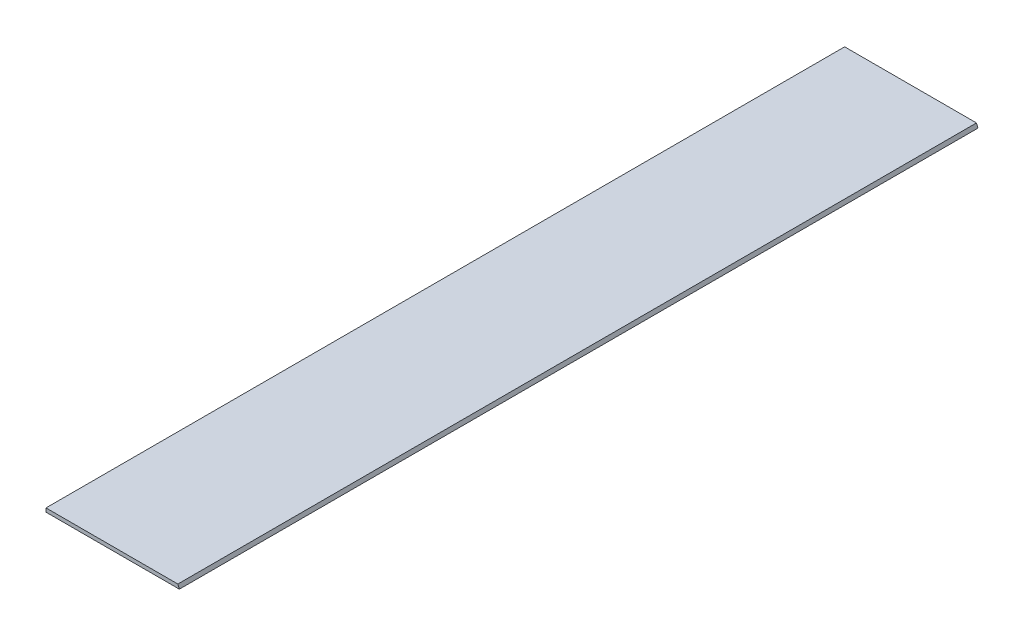
ISO-10303-21;
HEADER;
FILE_DESCRIPTION(('STEP AP214'),'2;1');
FILE_NAME('part.step','',(''),(''),'','','');
FILE_SCHEMA(('AUTOMOTIVE_DESIGN { 1 0 10303 214 1 1 1 1 }'));
ENDSEC;
DATA;
#1=APPLICATION_CONTEXT('core data for automotive mechanical design processes');
#2=APPLICATION_PROTOCOL_DEFINITION('international standard','automotive_design',2000,#1);
#3=PRODUCT_CONTEXT('',#1,'mechanical');
#4=PRODUCT('Part','Part','',(#3));
#5=PRODUCT_RELATED_PRODUCT_CATEGORY('part','',(#4));
#6=PRODUCT_DEFINITION_FORMATION('','',#4);
#7=PRODUCT_DEFINITION_CONTEXT('part definition',#1,'design');
#8=PRODUCT_DEFINITION('design','',#6,#7);
#9=PRODUCT_DEFINITION_SHAPE('','',#8);
#10=(LENGTH_UNIT() NAMED_UNIT(*) SI_UNIT(.MILLI.,.METRE.));
#11=(NAMED_UNIT(*) PLANE_ANGLE_UNIT() SI_UNIT($,.RADIAN.));
#12=(NAMED_UNIT(*) SI_UNIT($,.STERADIAN.) SOLID_ANGLE_UNIT());
#13=UNCERTAINTY_MEASURE_WITH_UNIT(LENGTH_MEASURE(1.E-05),#10,'distance_accuracy_value','');
#14=(GEOMETRIC_REPRESENTATION_CONTEXT(3) GLOBAL_UNCERTAINTY_ASSIGNED_CONTEXT((#13)) GLOBAL_UNIT_ASSIGNED_CONTEXT((#10,
#11,#12)) REPRESENTATION_CONTEXT('',''));
#15=CARTESIAN_POINT('',(0.,0.,0.));
#16=DIRECTION('',(0.,0.,1.));
#17=DIRECTION('',(1.,0.,0.));
#18=AXIS2_PLACEMENT_3D('',#15,#16,#17);
#19=CARTESIAN_POINT('',(84.836,0.,508.));
#20=DIRECTION('',(0.,1.,0.));
#21=DIRECTION('',(-1.,0.,0.));
#22=AXIS2_PLACEMENT_3D('',#19,#20,#21);
#23=PLANE('',#22);
#24=DIRECTION('',(1.,0.,0.));
#25=VECTOR('',#24,1.);
#26=CARTESIAN_POINT('',(84.836,0.,0.));
#27=LINE('',#26,#25);
#28=CARTESIAN_POINT('',(0.,0.,0.));
#29=VERTEX_POINT('',#28);
#30=CARTESIAN_POINT('',(84.836,0.,0.));
#31=VERTEX_POINT('',#30);
#32=EDGE_CURVE('E98',#29,#31,#27,.T.);
#33=ORIENTED_EDGE('',*,*,#32,.T.);
#34=DIRECTION('',(0.,0.,-1.));
#35=VECTOR('',#34,1.);
#36=CARTESIAN_POINT('',(84.836,0.,508.));
#37=LINE('',#36,#35);
#38=CARTESIAN_POINT('',(84.836,0.,508.));
#39=VERTEX_POINT('',#38);
#40=EDGE_CURVE('E11',#39,#31,#37,.T.);
#41=ORIENTED_EDGE('',*,*,#40,.F.);
#42=DIRECTION('',(1.,0.,0.));
#43=VECTOR('',#42,1.);
#44=CARTESIAN_POINT('',(84.836,0.,508.));
#45=LINE('',#44,#43);
#46=CARTESIAN_POINT('',(0.,0.,508.));
#47=VERTEX_POINT('',#46);
#48=EDGE_CURVE('E86',#47,#39,#45,.T.);
#49=ORIENTED_EDGE('',*,*,#48,.F.);
#50=DIRECTION('',(0.,0.,-1.));
#51=VECTOR('',#50,1.);
#52=CARTESIAN_POINT('',(0.,0.,508.));
#53=LINE('',#52,#51);
#54=EDGE_CURVE('E94',#47,#29,#53,.T.);
#55=ORIENTED_EDGE('',*,*,#54,.T.);
#56=EDGE_LOOP('',(#33,#41,#49,#55));
#57=FACE_BOUND('',#56,.T.);
#58=ADVANCED_FACE('F35',(#57),#23,.F.);
#59=CARTESIAN_POINT('',(83.8575447229623,2.36219999999999,508.));
#60=DIRECTION('',(-0.923879532511286,-0.382683432365092,0.));
#61=DIRECTION('',(0.382683432365092,-0.923879532511286,0.));
#62=AXIS2_PLACEMENT_3D('',#59,#60,#61);
#63=PLANE('',#62);
#64=DIRECTION('',(-0.382683432365092,0.923879532511286,0.));
#65=VECTOR('',#64,1.);
#66=CARTESIAN_POINT('',(83.8575447229623,2.36219999999999,0.));
#67=LINE('',#66,#65);
#68=CARTESIAN_POINT('',(83.8575447229623,2.36219999999999,0.));
#69=VERTEX_POINT('',#68);
#70=EDGE_CURVE('E90',#31,#69,#67,.T.);
#71=ORIENTED_EDGE('',*,*,#70,.T.);
#72=DIRECTION('',(0.,0.,-1.));
#73=VECTOR('',#72,1.);
#74=CARTESIAN_POINT('',(83.8575447229623,2.36219999999999,508.));
#75=LINE('',#74,#73);
#76=CARTESIAN_POINT('',(83.8575447229623,2.36219999999999,508.));
#77=VERTEX_POINT('',#76);
#78=EDGE_CURVE('E43',#77,#69,#75,.T.);
#79=ORIENTED_EDGE('',*,*,#78,.F.);
#80=DIRECTION('',(-0.382683432365092,0.923879532511286,0.));
#81=VECTOR('',#80,1.);
#82=CARTESIAN_POINT('',(83.8575447229623,2.36219999999999,508.));
#83=LINE('',#82,#81);
#84=EDGE_CURVE('E81',#39,#77,#83,.T.);
#85=ORIENTED_EDGE('',*,*,#84,.F.);
#86=ORIENTED_EDGE('',*,*,#40,.T.);
#87=EDGE_LOOP('',(#71,#79,#85,#86));
#88=FACE_BOUND('',#87,.T.);
#89=ADVANCED_FACE('F89',(#88),#63,.F.);
#90=CARTESIAN_POINT('',(0.,2.36219999999999,508.));
#91=DIRECTION('',(0.,-1.,0.));
#92=DIRECTION('',(0.,0.,-1.));
#93=AXIS2_PLACEMENT_3D('',#90,#91,#92);
#94=PLANE('',#93);
#95=DIRECTION('',(-1.,0.,0.));
#96=VECTOR('',#95,1.);
#97=CARTESIAN_POINT('',(0.,2.36219999999999,0.));
#98=LINE('',#97,#96);
#99=CARTESIAN_POINT('',(0.,2.36219999999999,0.));
#100=VERTEX_POINT('',#99);
#101=EDGE_CURVE('E68',#69,#100,#98,.T.);
#102=ORIENTED_EDGE('',*,*,#101,.T.);
#103=DIRECTION('',(0.,0.,-1.));
#104=VECTOR('',#103,1.);
#105=CARTESIAN_POINT('',(0.,2.36219999999999,508.));
#106=LINE('',#105,#104);
#107=CARTESIAN_POINT('',(0.,2.36219999999999,508.));
#108=VERTEX_POINT('',#107);
#109=EDGE_CURVE('E91',#108,#100,#106,.T.);
#110=ORIENTED_EDGE('',*,*,#109,.F.);
#111=DIRECTION('',(-1.,0.,0.));
#112=VECTOR('',#111,1.);
#113=CARTESIAN_POINT('',(0.,2.36219999999999,508.));
#114=LINE('',#113,#112);
#115=EDGE_CURVE('E84',#77,#108,#114,.T.);
#116=ORIENTED_EDGE('',*,*,#115,.F.);
#117=ORIENTED_EDGE('',*,*,#78,.T.);
#118=EDGE_LOOP('',(#102,#110,#116,#117));
#119=FACE_BOUND('',#118,.T.);
#120=ADVANCED_FACE('F92',(#119),#94,.F.);
#121=CARTESIAN_POINT('',(0.,0.,508.));
#122=DIRECTION('',(1.,0.,0.));
#123=DIRECTION('',(0.,0.,-1.));
#124=AXIS2_PLACEMENT_3D('',#121,#122,#123);
#125=PLANE('',#124);
#126=DIRECTION('',(0.,-1.,0.));
#127=VECTOR('',#126,1.);
#128=CARTESIAN_POINT('',(0.,0.,0.));
#129=LINE('',#128,#127);
#130=EDGE_CURVE('E74',#100,#29,#129,.T.);
#131=ORIENTED_EDGE('',*,*,#130,.T.);
#132=ORIENTED_EDGE('',*,*,#54,.F.);
#133=DIRECTION('',(0.,-1.,0.));
#134=VECTOR('',#133,1.);
#135=CARTESIAN_POINT('',(0.,0.,508.));
#136=LINE('',#135,#134);
#137=EDGE_CURVE('E51',#108,#47,#136,.T.);
#138=ORIENTED_EDGE('',*,*,#137,.F.);
#139=ORIENTED_EDGE('',*,*,#109,.T.);
#140=EDGE_LOOP('',(#131,#132,#138,#139));
#141=FACE_BOUND('',#140,.T.);
#142=ADVANCED_FACE('F105',(#141),#125,.F.);
#143=CARTESIAN_POINT('',(0.,0.,508.));
#144=DIRECTION('',(0.,0.,-1.));
#145=DIRECTION('',(-1.,0.,0.));
#146=AXIS2_PLACEMENT_3D('',#143,#144,#145);
#147=PLANE('',#146);
#148=ORIENTED_EDGE('',*,*,#48,.T.);
#149=ORIENTED_EDGE('',*,*,#84,.T.);
#150=ORIENTED_EDGE('',*,*,#115,.T.);
#151=ORIENTED_EDGE('',*,*,#137,.T.);
#152=EDGE_LOOP('',(#148,#149,#150,#151));
#153=FACE_BOUND('',#152,.T.);
#154=ADVANCED_FACE('F82',(#153),#147,.F.);
#155=CARTESIAN_POINT('',(0.,0.,0.));
#156=DIRECTION('',(0.,0.,-1.));
#157=DIRECTION('',(-1.,0.,0.));
#158=AXIS2_PLACEMENT_3D('',#155,#156,#157);
#159=PLANE('',#158);
#160=ORIENTED_EDGE('',*,*,#32,.F.);
#161=ORIENTED_EDGE('',*,*,#130,.F.);
#162=ORIENTED_EDGE('',*,*,#101,.F.);
#163=ORIENTED_EDGE('',*,*,#70,.F.);
#164=EDGE_LOOP('',(#160,#161,#162,#163));
#165=FACE_BOUND('',#164,.T.);
#166=ADVANCED_FACE('F108',(#165),#159,.T.);
#167=CLOSED_SHELL('',(#58,#89,#120,#142,#154,#166));
#168=MANIFOLD_SOLID_BREP('B2',#167);
#169=ADVANCED_BREP_SHAPE_REPRESENTATION('',(#18,#168),#14);
#170=SHAPE_DEFINITION_REPRESENTATION(#9,#169);
ENDSEC;
END-ISO-10303-21;
